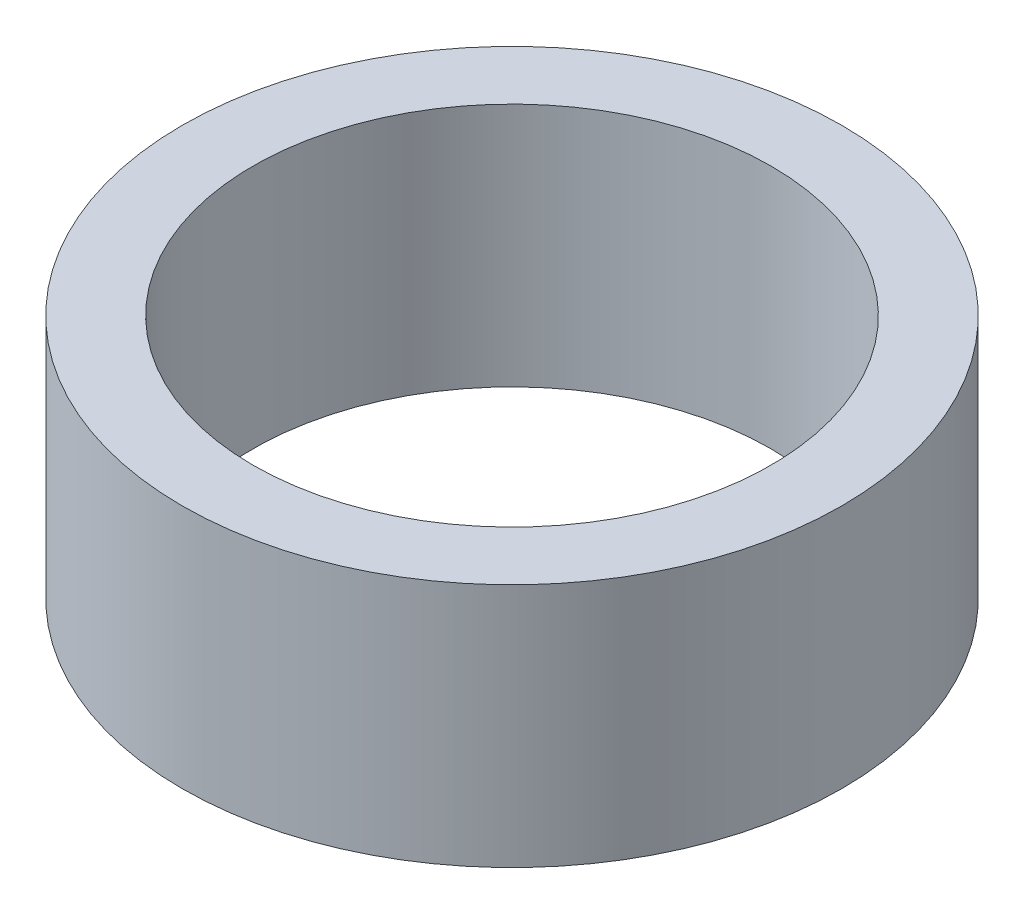
ISO-10303-21;
HEADER;
FILE_DESCRIPTION(('STEP AP214'),'2;1');
FILE_NAME('part.step','',(''),(''),'','','');
FILE_SCHEMA(('AUTOMOTIVE_DESIGN { 1 0 10303 214 1 1 1 1 }'));
ENDSEC;
DATA;
#1=APPLICATION_CONTEXT('core data for automotive mechanical design processes');
#2=APPLICATION_PROTOCOL_DEFINITION('international standard','automotive_design',2000,#1);
#3=PRODUCT_CONTEXT('',#1,'mechanical');
#4=PRODUCT('Part','Part','',(#3));
#5=PRODUCT_RELATED_PRODUCT_CATEGORY('part','',(#4));
#6=PRODUCT_DEFINITION_FORMATION('','',#4);
#7=PRODUCT_DEFINITION_CONTEXT('part definition',#1,'design');
#8=PRODUCT_DEFINITION('design','',#6,#7);
#9=PRODUCT_DEFINITION_SHAPE('','',#8);
#10=(LENGTH_UNIT() NAMED_UNIT(*) SI_UNIT(.MILLI.,.METRE.));
#11=(NAMED_UNIT(*) PLANE_ANGLE_UNIT() SI_UNIT($,.RADIAN.));
#12=(NAMED_UNIT(*) SI_UNIT($,.STERADIAN.) SOLID_ANGLE_UNIT());
#13=UNCERTAINTY_MEASURE_WITH_UNIT(LENGTH_MEASURE(1.E-05),#10,'distance_accuracy_value','');
#14=(GEOMETRIC_REPRESENTATION_CONTEXT(3) GLOBAL_UNCERTAINTY_ASSIGNED_CONTEXT((#13)) GLOBAL_UNIT_ASSIGNED_CONTEXT((#10,
#11,#12)) REPRESENTATION_CONTEXT('',''));
#15=CARTESIAN_POINT('',(0.,0.,0.));
#16=DIRECTION('',(0.,0.,1.));
#17=DIRECTION('',(1.,0.,0.));
#18=AXIS2_PLACEMENT_3D('',#15,#16,#17);
#19=CARTESIAN_POINT('',(0.,26.,0.));
#20=DIRECTION('',(0.,-1.,0.));
#21=DIRECTION('',(0.,0.,-1.));
#22=AXIS2_PLACEMENT_3D('',#19,#20,#21);
#23=CYLINDRICAL_SURFACE('',#22,35.);
#24=CARTESIAN_POINT('',(0.,26.,0.));
#25=DIRECTION('',(0.,1.,0.));
#26=DIRECTION('',(0.,0.,1.));
#27=AXIS2_PLACEMENT_3D('',#24,#25,#26);
#28=CIRCLE('',#27,35.);
#29=CARTESIAN_POINT('',(0.,26.,-35.));
#30=VERTEX_POINT('',#29);
#31=EDGE_CURVE('E10',#30,#30,#28,.T.);
#32=CARTESIAN_POINT('',(0.,0.,0.));
#33=DIRECTION('',(0.,1.,0.));
#34=DIRECTION('',(0.,0.,1.));
#35=AXIS2_PLACEMENT_3D('',#32,#33,#34);
#36=CIRCLE('',#35,35.);
#37=CARTESIAN_POINT('',(0.,0.,-35.));
#38=VERTEX_POINT('',#37);
#39=EDGE_CURVE('E37',#38,#38,#36,.T.);
#40=CARTESIAN_POINT('',(0.,26.,-35.));
#41=CARTESIAN_POINT('',(0.,25.7291666666667,-35.));
#42=CARTESIAN_POINT('',(0.,25.4583333333333,-35.));
#43=CARTESIAN_POINT('',(0.,24.9166666666667,-35.));
#44=CARTESIAN_POINT('',(0.,24.6458333333333,-35.));
#45=CARTESIAN_POINT('',(0.,24.1041666666667,-35.));
#46=CARTESIAN_POINT('',(0.,23.8333333333333,-35.));
#47=CARTESIAN_POINT('',(0.,23.2916666666667,-35.));
#48=CARTESIAN_POINT('',(0.,23.0208333333333,-35.));
#49=CARTESIAN_POINT('',(0.,22.4791666666667,-35.));
#50=CARTESIAN_POINT('',(0.,22.2083333333333,-35.));
#51=CARTESIAN_POINT('',(0.,21.6666666666667,-35.));
#52=CARTESIAN_POINT('',(0.,21.3958333333333,-35.));
#53=CARTESIAN_POINT('',(0.,20.8541666666667,-35.));
#54=CARTESIAN_POINT('',(0.,20.5833333333333,-35.));
#55=CARTESIAN_POINT('',(0.,20.0416666666667,-35.));
#56=CARTESIAN_POINT('',(0.,19.7708333333333,-35.));
#57=CARTESIAN_POINT('',(0.,19.2291666666667,-35.));
#58=CARTESIAN_POINT('',(0.,18.9583333333333,-35.));
#59=CARTESIAN_POINT('',(0.,18.4166666666667,-35.));
#60=CARTESIAN_POINT('',(0.,18.1458333333333,-35.));
#61=CARTESIAN_POINT('',(0.,17.6041666666667,-35.));
#62=CARTESIAN_POINT('',(0.,17.3333333333333,-35.));
#63=CARTESIAN_POINT('',(0.,16.7916666666667,-35.));
#64=CARTESIAN_POINT('',(0.,16.5208333333333,-35.));
#65=CARTESIAN_POINT('',(0.,15.9791666666667,-35.));
#66=CARTESIAN_POINT('',(0.,15.7083333333333,-35.));
#67=CARTESIAN_POINT('',(0.,15.1666666666667,-35.));
#68=CARTESIAN_POINT('',(0.,14.8958333333333,-35.));
#69=CARTESIAN_POINT('',(0.,14.3541666666667,-35.));
#70=CARTESIAN_POINT('',(0.,14.0833333333333,-35.));
#71=CARTESIAN_POINT('',(0.,13.5416666666667,-35.));
#72=CARTESIAN_POINT('',(0.,13.2708333333333,-35.));
#73=CARTESIAN_POINT('',(0.,12.7291666666667,-35.));
#74=CARTESIAN_POINT('',(0.,12.4583333333333,-35.));
#75=CARTESIAN_POINT('',(0.,11.9166666666667,-35.));
#76=CARTESIAN_POINT('',(0.,11.6458333333333,-35.));
#77=CARTESIAN_POINT('',(0.,11.1041666666667,-35.));
#78=CARTESIAN_POINT('',(0.,10.8333333333333,-35.));
#79=CARTESIAN_POINT('',(0.,10.2916666666667,-35.));
#80=CARTESIAN_POINT('',(0.,10.0208333333333,-35.));
#81=CARTESIAN_POINT('',(0.,9.47916666666667,-35.));
#82=CARTESIAN_POINT('',(0.,9.20833333333333,-35.));
#83=CARTESIAN_POINT('',(0.,8.66666666666667,-35.));
#84=CARTESIAN_POINT('',(0.,8.39583333333333,-35.));
#85=CARTESIAN_POINT('',(0.,7.85416666666667,-35.));
#86=CARTESIAN_POINT('',(0.,7.58333333333333,-35.));
#87=CARTESIAN_POINT('',(0.,7.04166666666667,-35.));
#88=CARTESIAN_POINT('',(0.,6.77083333333333,-35.));
#89=CARTESIAN_POINT('',(0.,6.22916666666667,-35.));
#90=CARTESIAN_POINT('',(0.,5.95833333333333,-35.));
#91=CARTESIAN_POINT('',(0.,5.41666666666667,-35.));
#92=CARTESIAN_POINT('',(0.,5.14583333333333,-35.));
#93=CARTESIAN_POINT('',(0.,4.60416666666667,-35.));
#94=CARTESIAN_POINT('',(0.,4.33333333333333,-35.));
#95=CARTESIAN_POINT('',(0.,3.79166666666667,-35.));
#96=CARTESIAN_POINT('',(0.,3.52083333333333,-35.));
#97=CARTESIAN_POINT('',(0.,2.97916666666667,-35.));
#98=CARTESIAN_POINT('',(0.,2.70833333333333,-35.));
#99=CARTESIAN_POINT('',(0.,2.16666666666667,-35.));
#100=CARTESIAN_POINT('',(0.,1.89583333333333,-35.));
#101=CARTESIAN_POINT('',(0.,1.35416666666667,-35.));
#102=CARTESIAN_POINT('',(0.,1.08333333333333,-35.));
#103=CARTESIAN_POINT('',(0.,0.541666666666667,-35.));
#104=CARTESIAN_POINT('',(0.,0.270833333333334,-35.));
#105=CARTESIAN_POINT('',(0.,0.,-35.));
#106=B_SPLINE_CURVE_WITH_KNOTS('',3,(#40,#41,#42,#43,#44,#45,#46,#47,#48,#49,#50,#51,#52,#53,
#54,#55,#56,#57,#58,#59,#60,#61,#62,#63,#64,#65,#66,#67,#68,#69,#70,#71,#72,#73,#74,#75,#76,#77,
#78,#79,#80,#81,#82,#83,#84,#85,#86,#87,#88,#89,#90,#91,#92,#93,#94,#95,#96,#97,#98,#99,#100,
#101,#102,#103,#104,#105),.UNSPECIFIED.,.F.,.F.,(4,2,2,2,2,2,2,2,2,2,2,2,2,2,2,2,2,2,2,2,2,2,2,
2,2,2,2,2,2,2,2,2,4),(0.,0.812499999999997,1.625,2.4375,3.25,4.0625,4.875,5.6875,6.5,7.3125,
8.125,8.93749999999999,9.74999999999999,10.5625,11.375,12.1875,13.,13.8125,14.625,15.4375,16.25,
17.0625,17.875,18.6875,19.5,20.3125,21.125,21.9375,22.75,23.5625,24.375,25.1875,26.),.UNSPECIFIED.);
#107=EDGE_CURVE('BSEAM40',#30,#38,#106,.T.);
#108=ORIENTED_EDGE('',*,*,#31,.F.);
#109=ORIENTED_EDGE('',*,*,#39,.T.);
#110=ORIENTED_EDGE('',*,*,#107,.T.);
#111=ORIENTED_EDGE('',*,*,#107,.F.);
#112=EDGE_LOOP('',(#108,#110,#109,#111));
#113=FACE_BOUND('',#112,.T.);
#114=ADVANCED_FACE('F40',(#113),#23,.T.);
#115=CARTESIAN_POINT('',(0.,26.,0.));
#116=DIRECTION('',(0.,1.,0.));
#117=DIRECTION('',(0.,0.,1.));
#118=AXIS2_PLACEMENT_3D('',#115,#116,#117);
#119=PLANE('',#118);
#120=CARTESIAN_POINT('',(0.,26.,0.));
#121=DIRECTION('',(0.,1.,0.));
#122=DIRECTION('',(0.,0.,1.));
#123=AXIS2_PLACEMENT_3D('',#120,#121,#122);
#124=CIRCLE('',#123,27.5);
#125=CARTESIAN_POINT('',(0.,26.,-27.5));
#126=VERTEX_POINT('',#125);
#127=EDGE_CURVE('E50',#126,#126,#124,.T.);
#128=ORIENTED_EDGE('',*,*,#127,.F.);
#129=EDGE_LOOP('',(#128));
#130=FACE_BOUND('',#129,.T.);
#131=ORIENTED_EDGE('',*,*,#31,.T.);
#132=EDGE_LOOP('',(#131));
#133=FACE_BOUND('',#132,.T.);
#134=ADVANCED_FACE('F59',(#130,#133),#119,.T.);
#135=CARTESIAN_POINT('',(0.,0.,0.));
#136=DIRECTION('',(0.,1.,0.));
#137=DIRECTION('',(0.,0.,1.));
#138=AXIS2_PLACEMENT_3D('',#135,#136,#137);
#139=PLANE('',#138);
#140=CARTESIAN_POINT('',(0.,0.,0.));
#141=DIRECTION('',(0.,1.,0.));
#142=DIRECTION('',(0.,0.,1.));
#143=AXIS2_PLACEMENT_3D('',#140,#141,#142);
#144=CIRCLE('',#143,27.5);
#145=CARTESIAN_POINT('',(0.,0.,-27.5));
#146=VERTEX_POINT('',#145);
#147=EDGE_CURVE('E47',#146,#146,#144,.T.);
#148=ORIENTED_EDGE('',*,*,#147,.T.);
#149=EDGE_LOOP('',(#148));
#150=FACE_BOUND('',#149,.T.);
#151=ORIENTED_EDGE('',*,*,#39,.F.);
#152=EDGE_LOOP('',(#151));
#153=FACE_BOUND('',#152,.T.);
#154=ADVANCED_FACE('F58',(#150,#153),#139,.F.);
#155=CARTESIAN_POINT('',(0.,26.,0.));
#156=DIRECTION('',(0.,-1.,0.));
#157=DIRECTION('',(0.,0.,-1.));
#158=AXIS2_PLACEMENT_3D('',#155,#156,#157);
#159=CYLINDRICAL_SURFACE('',#158,27.5);
#160=CARTESIAN_POINT('',(0.,26.,-27.5));
#161=CARTESIAN_POINT('',(0.,25.7291666666667,-27.5));
#162=CARTESIAN_POINT('',(0.,25.4583333333333,-27.5));
#163=CARTESIAN_POINT('',(0.,24.9166666666667,-27.5));
#164=CARTESIAN_POINT('',(0.,24.6458333333333,-27.5));
#165=CARTESIAN_POINT('',(0.,24.1041666666667,-27.5));
#166=CARTESIAN_POINT('',(0.,23.8333333333333,-27.5));
#167=CARTESIAN_POINT('',(0.,23.2916666666667,-27.5));
#168=CARTESIAN_POINT('',(0.,23.0208333333333,-27.5));
#169=CARTESIAN_POINT('',(0.,22.4791666666667,-27.5));
#170=CARTESIAN_POINT('',(0.,22.2083333333333,-27.5));
#171=CARTESIAN_POINT('',(0.,21.6666666666667,-27.5));
#172=CARTESIAN_POINT('',(0.,21.3958333333333,-27.5));
#173=CARTESIAN_POINT('',(0.,20.8541666666667,-27.5));
#174=CARTESIAN_POINT('',(0.,20.5833333333333,-27.5));
#175=CARTESIAN_POINT('',(0.,20.0416666666667,-27.5));
#176=CARTESIAN_POINT('',(0.,19.7708333333333,-27.5));
#177=CARTESIAN_POINT('',(0.,19.2291666666667,-27.5));
#178=CARTESIAN_POINT('',(0.,18.9583333333333,-27.5));
#179=CARTESIAN_POINT('',(0.,18.4166666666667,-27.5));
#180=CARTESIAN_POINT('',(0.,18.1458333333333,-27.5));
#181=CARTESIAN_POINT('',(0.,17.6041666666667,-27.5));
#182=CARTESIAN_POINT('',(0.,17.3333333333333,-27.5));
#183=CARTESIAN_POINT('',(0.,16.7916666666667,-27.5));
#184=CARTESIAN_POINT('',(0.,16.5208333333333,-27.5));
#185=CARTESIAN_POINT('',(0.,15.9791666666667,-27.5));
#186=CARTESIAN_POINT('',(0.,15.7083333333333,-27.5));
#187=CARTESIAN_POINT('',(0.,15.1666666666667,-27.5));
#188=CARTESIAN_POINT('',(0.,14.8958333333333,-27.5));
#189=CARTESIAN_POINT('',(0.,14.3541666666667,-27.5));
#190=CARTESIAN_POINT('',(0.,14.0833333333333,-27.5));
#191=CARTESIAN_POINT('',(0.,13.5416666666667,-27.5));
#192=CARTESIAN_POINT('',(0.,13.2708333333333,-27.5));
#193=CARTESIAN_POINT('',(0.,12.7291666666667,-27.5));
#194=CARTESIAN_POINT('',(0.,12.4583333333333,-27.5));
#195=CARTESIAN_POINT('',(0.,11.9166666666667,-27.5));
#196=CARTESIAN_POINT('',(0.,11.6458333333333,-27.5));
#197=CARTESIAN_POINT('',(0.,11.1041666666667,-27.5));
#198=CARTESIAN_POINT('',(0.,10.8333333333333,-27.5));
#199=CARTESIAN_POINT('',(0.,10.2916666666667,-27.5));
#200=CARTESIAN_POINT('',(0.,10.0208333333333,-27.5));
#201=CARTESIAN_POINT('',(0.,9.47916666666667,-27.5));
#202=CARTESIAN_POINT('',(0.,9.20833333333333,-27.5));
#203=CARTESIAN_POINT('',(0.,8.66666666666667,-27.5));
#204=CARTESIAN_POINT('',(0.,8.39583333333333,-27.5));
#205=CARTESIAN_POINT('',(0.,7.85416666666667,-27.5));
#206=CARTESIAN_POINT('',(0.,7.58333333333333,-27.5));
#207=CARTESIAN_POINT('',(0.,7.04166666666667,-27.5));
#208=CARTESIAN_POINT('',(0.,6.77083333333333,-27.5));
#209=CARTESIAN_POINT('',(0.,6.22916666666667,-27.5));
#210=CARTESIAN_POINT('',(0.,5.95833333333333,-27.5));
#211=CARTESIAN_POINT('',(0.,5.41666666666667,-27.5));
#212=CARTESIAN_POINT('',(0.,5.14583333333333,-27.5));
#213=CARTESIAN_POINT('',(0.,4.60416666666667,-27.5));
#214=CARTESIAN_POINT('',(0.,4.33333333333333,-27.5));
#215=CARTESIAN_POINT('',(0.,3.79166666666667,-27.5));
#216=CARTESIAN_POINT('',(0.,3.52083333333333,-27.5));
#217=CARTESIAN_POINT('',(0.,2.97916666666667,-27.5));
#218=CARTESIAN_POINT('',(0.,2.70833333333333,-27.5));
#219=CARTESIAN_POINT('',(0.,2.16666666666667,-27.5));
#220=CARTESIAN_POINT('',(0.,1.89583333333333,-27.5));
#221=CARTESIAN_POINT('',(0.,1.35416666666667,-27.5));
#222=CARTESIAN_POINT('',(0.,1.08333333333333,-27.5));
#223=CARTESIAN_POINT('',(0.,0.541666666666667,-27.5));
#224=CARTESIAN_POINT('',(0.,0.270833333333334,-27.5));
#225=CARTESIAN_POINT('',(0.,0.,-27.5));
#226=B_SPLINE_CURVE_WITH_KNOTS('',3,(#160,#161,#162,#163,#164,#165,#166,#167,#168,#169,#170,
#171,#172,#173,#174,#175,#176,#177,#178,#179,#180,#181,#182,#183,#184,#185,#186,#187,#188,#189,
#190,#191,#192,#193,#194,#195,#196,#197,#198,#199,#200,#201,#202,#203,#204,#205,#206,#207,#208,
#209,#210,#211,#212,#213,#214,#215,#216,#217,#218,#219,#220,#221,#222,#223,#224,#225),
.UNSPECIFIED.,.F.,.F.,(4,2,2,2,2,2,2,2,2,2,2,2,2,2,2,2,2,2,2,2,2,2,2,2,2,2,2,2,2,2,2,2,4),(0.,
0.812500000000001,1.625,2.4375,3.25,4.0625,4.875,5.6875,6.5,7.3125,8.125,8.9375,9.75,10.5625,
11.375,12.1875,13.,13.8125,14.625,15.4375,16.25,17.0625,17.875,18.6875,19.5,20.3125,21.125,
21.9375,22.75,23.5625,24.375,25.1875,26.),.UNSPECIFIED.);
#227=EDGE_CURVE('BSEAM54',#126,#146,#226,.T.);
#228=ORIENTED_EDGE('',*,*,#127,.T.);
#229=ORIENTED_EDGE('',*,*,#147,.F.);
#230=ORIENTED_EDGE('',*,*,#227,.T.);
#231=ORIENTED_EDGE('',*,*,#227,.F.);
#232=EDGE_LOOP('',(#228,#230,#229,#231));
#233=FACE_BOUND('',#232,.T.);
#234=ADVANCED_FACE('F54',(#233),#159,.F.);
#235=CLOSED_SHELL('',(#114,#134,#154,#234));
#236=MANIFOLD_SOLID_BREP('B2',#235);
#237=ADVANCED_BREP_SHAPE_REPRESENTATION('',(#18,#236),#14);
#238=SHAPE_DEFINITION_REPRESENTATION(#9,#237);
ENDSEC;
END-ISO-10303-21;
